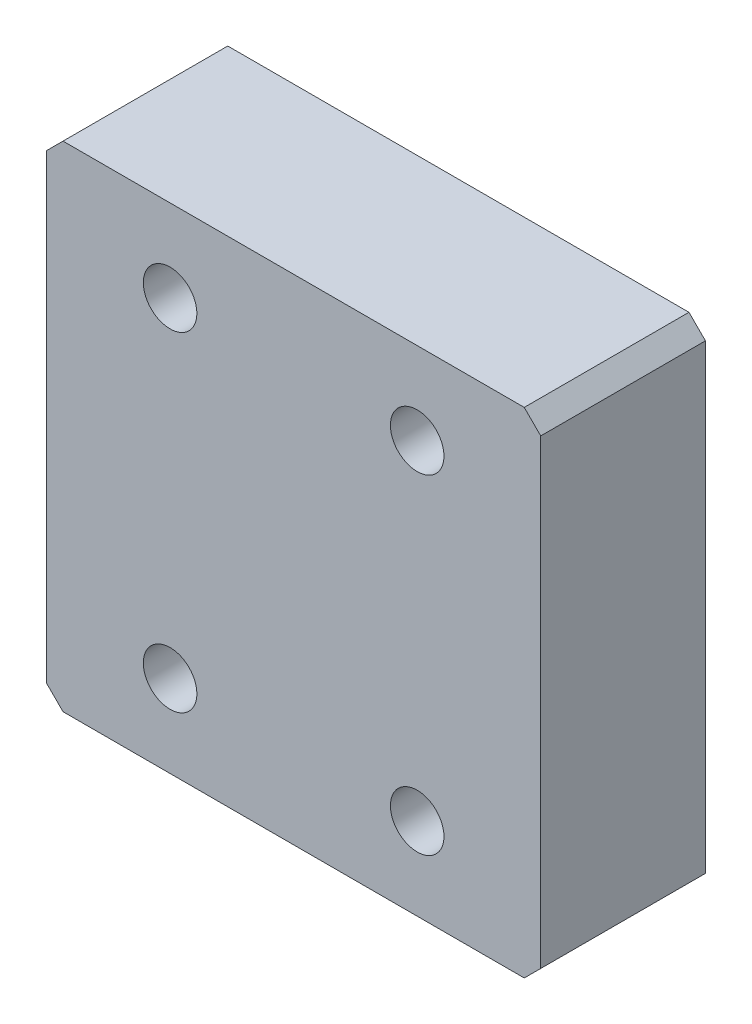
ISO-10303-21;
HEADER;
FILE_DESCRIPTION(('STEP AP214'),'2;1');
FILE_NAME('part.step','',(''),(''),'','','');
FILE_SCHEMA(('AUTOMOTIVE_DESIGN { 1 0 10303 214 1 1 1 1 }'));
ENDSEC;
DATA;
#1=APPLICATION_CONTEXT('core data for automotive mechanical design processes');
#2=APPLICATION_PROTOCOL_DEFINITION('international standard','automotive_design',2000,#1);
#3=PRODUCT_CONTEXT('',#1,'mechanical');
#4=PRODUCT('Part','Part','',(#3));
#5=PRODUCT_RELATED_PRODUCT_CATEGORY('part','',(#4));
#6=PRODUCT_DEFINITION_FORMATION('','',#4);
#7=PRODUCT_DEFINITION_CONTEXT('part definition',#1,'design');
#8=PRODUCT_DEFINITION('design','',#6,#7);
#9=PRODUCT_DEFINITION_SHAPE('','',#8);
#10=(LENGTH_UNIT() NAMED_UNIT(*) SI_UNIT(.MILLI.,.METRE.));
#11=(NAMED_UNIT(*) PLANE_ANGLE_UNIT() SI_UNIT($,.RADIAN.));
#12=(NAMED_UNIT(*) SI_UNIT($,.STERADIAN.) SOLID_ANGLE_UNIT());
#13=UNCERTAINTY_MEASURE_WITH_UNIT(LENGTH_MEASURE(1.E-05),#10,'distance_accuracy_value','');
#14=(GEOMETRIC_REPRESENTATION_CONTEXT(3) GLOBAL_UNCERTAINTY_ASSIGNED_CONTEXT((#13)) GLOBAL_UNIT_ASSIGNED_CONTEXT((#10,
#11,#12)) REPRESENTATION_CONTEXT('',''));
#15=CARTESIAN_POINT('',(0.,0.,0.));
#16=DIRECTION('',(0.,0.,1.));
#17=DIRECTION('',(1.,0.,0.));
#18=AXIS2_PLACEMENT_3D('',#15,#16,#17);
#19=CARTESIAN_POINT('',(0.,0.,20.));
#20=DIRECTION('',(0.,0.,1.));
#21=DIRECTION('',(1.,0.,0.));
#22=AXIS2_PLACEMENT_3D('',#19,#20,#21);
#23=PLANE('',#22);
#24=CARTESIAN_POINT('',(15.,-20.,20.));
#25=DIRECTION('',(0.,0.,1.));
#26=DIRECTION('',(1.,0.,0.));
#27=AXIS2_PLACEMENT_3D('',#24,#25,#26);
#28=CIRCLE('',#27,3.25);
#29=CARTESIAN_POINT('',(18.25,-20.,20.));
#30=VERTEX_POINT('',#29);
#31=EDGE_CURVE('E186',#30,#30,#28,.T.);
#32=ORIENTED_EDGE('',*,*,#31,.F.);
#33=EDGE_LOOP('',(#32));
#34=FACE_BOUND('',#33,.T.);
#35=CARTESIAN_POINT('',(-15.,20.,20.));
#36=DIRECTION('',(0.,0.,1.));
#37=DIRECTION('',(1.,0.,0.));
#38=AXIS2_PLACEMENT_3D('',#35,#36,#37);
#39=CIRCLE('',#38,3.25);
#40=CARTESIAN_POINT('',(-11.75,20.,20.));
#41=VERTEX_POINT('',#40);
#42=EDGE_CURVE('E127',#41,#41,#39,.T.);
#43=ORIENTED_EDGE('',*,*,#42,.F.);
#44=EDGE_LOOP('',(#43));
#45=FACE_BOUND('',#44,.T.);
#46=DIRECTION('',(1.,0.,0.));
#47=VECTOR('',#46,1.);
#48=CARTESIAN_POINT('',(-30.,-30.,20.));
#49=LINE('',#48,#47);
#50=CARTESIAN_POINT('',(-28.,-30.,20.));
#51=VERTEX_POINT('',#50);
#52=CARTESIAN_POINT('',(28.,-30.,20.));
#53=VERTEX_POINT('',#52);
#54=EDGE_CURVE('E136',#51,#53,#49,.T.);
#55=ORIENTED_EDGE('',*,*,#54,.T.);
#56=DIRECTION('',(-0.707106781186549,-0.707106781186546,0.));
#57=VECTOR('',#56,1.);
#58=CARTESIAN_POINT('',(28.9999999999999,-29.,20.));
#59=LINE('',#58,#57);
#60=CARTESIAN_POINT('',(30.,-28.,20.));
#61=VERTEX_POINT('',#60);
#62=EDGE_CURVE('E155',#53,#61,#59,.F.);
#63=ORIENTED_EDGE('',*,*,#62,.T.);
#64=DIRECTION('',(0.,1.,0.));
#65=VECTOR('',#64,1.);
#66=CARTESIAN_POINT('',(30.,30.,20.));
#67=LINE('',#66,#65);
#68=CARTESIAN_POINT('',(30.,28.,20.));
#69=VERTEX_POINT('',#68);
#70=EDGE_CURVE('E119',#61,#69,#67,.T.);
#71=ORIENTED_EDGE('',*,*,#70,.T.);
#72=DIRECTION('',(0.707106781186545,-0.70710678118655,0.));
#73=VECTOR('',#72,1.);
#74=CARTESIAN_POINT('',(29.0000000000001,28.9999999999999,20.));
#75=LINE('',#74,#73);
#76=CARTESIAN_POINT('',(28.,30.,20.));
#77=VERTEX_POINT('',#76);
#78=EDGE_CURVE('E150',#69,#77,#75,.F.);
#79=ORIENTED_EDGE('',*,*,#78,.T.);
#80=DIRECTION('',(-1.,0.,0.));
#81=VECTOR('',#80,1.);
#82=CARTESIAN_POINT('',(-30.,30.,20.));
#83=LINE('',#82,#81);
#84=CARTESIAN_POINT('',(-28.,30.,20.));
#85=VERTEX_POINT('',#84);
#86=EDGE_CURVE('E166',#77,#85,#83,.T.);
#87=ORIENTED_EDGE('',*,*,#86,.T.);
#88=DIRECTION('',(0.707106781186549,0.707106781186546,0.));
#89=VECTOR('',#88,1.);
#90=CARTESIAN_POINT('',(-28.9999999999999,29.,20.));
#91=LINE('',#90,#89);
#92=CARTESIAN_POINT('',(-30.,28.,20.));
#93=VERTEX_POINT('',#92);
#94=EDGE_CURVE('E55',#85,#93,#91,.F.);
#95=ORIENTED_EDGE('',*,*,#94,.T.);
#96=DIRECTION('',(0.,-1.,0.));
#97=VECTOR('',#96,1.);
#98=CARTESIAN_POINT('',(-30.,30.,20.));
#99=LINE('',#98,#97);
#100=CARTESIAN_POINT('',(-30.,-28.,20.));
#101=VERTEX_POINT('',#100);
#102=EDGE_CURVE('E174',#93,#101,#99,.T.);
#103=ORIENTED_EDGE('',*,*,#102,.T.);
#104=DIRECTION('',(-0.707106781186545,0.70710678118655,0.));
#105=VECTOR('',#104,1.);
#106=CARTESIAN_POINT('',(-29.0000000000001,-28.9999999999999,20.));
#107=LINE('',#106,#105);
#108=EDGE_CURVE('E153',#101,#51,#107,.F.);
#109=ORIENTED_EDGE('',*,*,#108,.T.);
#110=EDGE_LOOP('',(#55,#63,#71,#79,#87,#95,#103,#109));
#111=FACE_BOUND('',#110,.T.);
#112=CARTESIAN_POINT('',(15.,20.,20.));
#113=DIRECTION('',(0.,0.,1.));
#114=DIRECTION('',(-1.,0.,0.));
#115=AXIS2_PLACEMENT_3D('',#112,#113,#114);
#116=CIRCLE('',#115,3.25);
#117=CARTESIAN_POINT('',(11.75,20.,20.));
#118=VERTEX_POINT('',#117);
#119=EDGE_CURVE('E181',#118,#118,#116,.T.);
#120=ORIENTED_EDGE('',*,*,#119,.F.);
#121=EDGE_LOOP('',(#120));
#122=FACE_BOUND('',#121,.T.);
#123=CARTESIAN_POINT('',(-15.,-20.,20.));
#124=DIRECTION('',(0.,0.,1.));
#125=DIRECTION('',(-1.,0.,0.));
#126=AXIS2_PLACEMENT_3D('',#123,#124,#125);
#127=CIRCLE('',#126,3.25);
#128=CARTESIAN_POINT('',(-18.25,-20.,20.));
#129=VERTEX_POINT('',#128);
#130=EDGE_CURVE('E192',#129,#129,#127,.T.);
#131=ORIENTED_EDGE('',*,*,#130,.F.);
#132=EDGE_LOOP('',(#131));
#133=FACE_BOUND('',#132,.T.);
#134=ADVANCED_FACE('F33',(#34,#45,#111,#122,#133),#23,.T.);
#135=CARTESIAN_POINT('',(0.,0.,0.));
#136=DIRECTION('',(0.,0.,1.));
#137=DIRECTION('',(1.,0.,0.));
#138=AXIS2_PLACEMENT_3D('',#135,#136,#137);
#139=PLANE('',#138);
#140=DIRECTION('',(0.,1.,0.));
#141=VECTOR('',#140,1.);
#142=CARTESIAN_POINT('',(30.,30.,0.));
#143=LINE('',#142,#141);
#144=CARTESIAN_POINT('',(30.,-28.,0.));
#145=VERTEX_POINT('',#144);
#146=CARTESIAN_POINT('',(30.,28.,0.));
#147=VERTEX_POINT('',#146);
#148=EDGE_CURVE('E116',#145,#147,#143,.T.);
#149=ORIENTED_EDGE('',*,*,#148,.F.);
#150=DIRECTION('',(0.707106781186549,0.707106781186546,0.));
#151=VECTOR('',#150,1.);
#152=CARTESIAN_POINT('',(30.,-28.,0.));
#153=LINE('',#152,#151);
#154=CARTESIAN_POINT('',(28.,-30.,0.));
#155=VERTEX_POINT('',#154);
#156=EDGE_CURVE('E99',#145,#155,#153,.F.);
#157=ORIENTED_EDGE('',*,*,#156,.T.);
#158=DIRECTION('',(1.,0.,0.));
#159=VECTOR('',#158,1.);
#160=CARTESIAN_POINT('',(-30.,-30.,0.));
#161=LINE('',#160,#159);
#162=CARTESIAN_POINT('',(-28.,-30.,0.));
#163=VERTEX_POINT('',#162);
#164=EDGE_CURVE('E140',#163,#155,#161,.T.);
#165=ORIENTED_EDGE('',*,*,#164,.F.);
#166=DIRECTION('',(0.707106781186545,-0.70710678118655,0.));
#167=VECTOR('',#166,1.);
#168=CARTESIAN_POINT('',(-28.,-30.,0.));
#169=LINE('',#168,#167);
#170=CARTESIAN_POINT('',(-30.,-28.,0.));
#171=VERTEX_POINT('',#170);
#172=EDGE_CURVE('E110',#163,#171,#169,.F.);
#173=ORIENTED_EDGE('',*,*,#172,.T.);
#174=DIRECTION('',(0.,-1.,0.));
#175=VECTOR('',#174,1.);
#176=CARTESIAN_POINT('',(-30.,30.,0.));
#177=LINE('',#176,#175);
#178=CARTESIAN_POINT('',(-30.,28.,0.));
#179=VERTEX_POINT('',#178);
#180=EDGE_CURVE('E130',#179,#171,#177,.T.);
#181=ORIENTED_EDGE('',*,*,#180,.F.);
#182=DIRECTION('',(-0.707106781186549,-0.707106781186546,0.));
#183=VECTOR('',#182,1.);
#184=CARTESIAN_POINT('',(-30.,28.,0.));
#185=LINE('',#184,#183);
#186=CARTESIAN_POINT('',(-28.,30.,0.));
#187=VERTEX_POINT('',#186);
#188=EDGE_CURVE('E144',#179,#187,#185,.F.);
#189=ORIENTED_EDGE('',*,*,#188,.T.);
#190=DIRECTION('',(-1.,0.,0.));
#191=VECTOR('',#190,1.);
#192=CARTESIAN_POINT('',(-30.,30.,0.));
#193=LINE('',#192,#191);
#194=CARTESIAN_POINT('',(28.,30.,0.));
#195=VERTEX_POINT('',#194);
#196=EDGE_CURVE('E126',#195,#187,#193,.T.);
#197=ORIENTED_EDGE('',*,*,#196,.F.);
#198=DIRECTION('',(-0.707106781186545,0.70710678118655,0.));
#199=VECTOR('',#198,1.);
#200=CARTESIAN_POINT('',(28.,30.,0.));
#201=LINE('',#200,#199);
#202=EDGE_CURVE('E120',#195,#147,#201,.F.);
#203=ORIENTED_EDGE('',*,*,#202,.T.);
#204=EDGE_LOOP('',(#149,#157,#165,#173,#181,#189,#197,#203));
#205=FACE_BOUND('',#204,.T.);
#206=CARTESIAN_POINT('',(-15.,20.,0.));
#207=DIRECTION('',(0.,0.,1.));
#208=DIRECTION('',(1.,0.,0.));
#209=AXIS2_PLACEMENT_3D('',#206,#207,#208);
#210=CIRCLE('',#209,3.25);
#211=CARTESIAN_POINT('',(-11.75,20.,0.));
#212=VERTEX_POINT('',#211);
#213=EDGE_CURVE('E133',#212,#212,#210,.T.);
#214=ORIENTED_EDGE('',*,*,#213,.T.);
#215=EDGE_LOOP('',(#214));
#216=FACE_BOUND('',#215,.T.);
#217=CARTESIAN_POINT('',(15.,20.,0.));
#218=DIRECTION('',(0.,0.,1.));
#219=DIRECTION('',(-1.,0.,0.));
#220=AXIS2_PLACEMENT_3D('',#217,#218,#219);
#221=CIRCLE('',#220,3.25);
#222=CARTESIAN_POINT('',(11.75,20.,0.));
#223=VERTEX_POINT('',#222);
#224=EDGE_CURVE('E183',#223,#223,#221,.T.);
#225=ORIENTED_EDGE('',*,*,#224,.T.);
#226=EDGE_LOOP('',(#225));
#227=FACE_BOUND('',#226,.T.);
#228=CARTESIAN_POINT('',(15.,-20.,0.));
#229=DIRECTION('',(0.,0.,1.));
#230=DIRECTION('',(1.,0.,0.));
#231=AXIS2_PLACEMENT_3D('',#228,#229,#230);
#232=CIRCLE('',#231,3.25);
#233=CARTESIAN_POINT('',(18.25,-20.,0.));
#234=VERTEX_POINT('',#233);
#235=EDGE_CURVE('E189',#234,#234,#232,.T.);
#236=ORIENTED_EDGE('',*,*,#235,.T.);
#237=EDGE_LOOP('',(#236));
#238=FACE_BOUND('',#237,.T.);
#239=CARTESIAN_POINT('',(-15.,-20.,0.));
#240=DIRECTION('',(0.,0.,1.));
#241=DIRECTION('',(-1.,0.,0.));
#242=AXIS2_PLACEMENT_3D('',#239,#240,#241);
#243=CIRCLE('',#242,3.25);
#244=CARTESIAN_POINT('',(-18.25,-20.,0.));
#245=VERTEX_POINT('',#244);
#246=EDGE_CURVE('E195',#245,#245,#243,.T.);
#247=ORIENTED_EDGE('',*,*,#246,.T.);
#248=EDGE_LOOP('',(#247));
#249=FACE_BOUND('',#248,.T.);
#250=ADVANCED_FACE('F123',(#205,#216,#227,#238,#249),#139,.F.);
#251=CARTESIAN_POINT('',(30.,30.,20.));
#252=DIRECTION('',(-1.,0.,0.));
#253=DIRECTION('',(0.,-1.,0.));
#254=AXIS2_PLACEMENT_3D('',#251,#252,#253);
#255=PLANE('',#254);
#256=ORIENTED_EDGE('',*,*,#70,.F.);
#257=DIRECTION('',(0.,0.,-1.));
#258=VECTOR('',#257,1.);
#259=CARTESIAN_POINT('',(30.,-28.,20.));
#260=LINE('',#259,#258);
#261=EDGE_CURVE('E103',#61,#145,#260,.T.);
#262=ORIENTED_EDGE('',*,*,#261,.T.);
#263=ORIENTED_EDGE('',*,*,#148,.T.);
#264=DIRECTION('',(0.,0.,1.));
#265=VECTOR('',#264,1.);
#266=CARTESIAN_POINT('',(30.,28.,20.));
#267=LINE('',#266,#265);
#268=EDGE_CURVE('E121',#147,#69,#267,.T.);
#269=ORIENTED_EDGE('',*,*,#268,.T.);
#270=EDGE_LOOP('',(#256,#262,#263,#269));
#271=FACE_BOUND('',#270,.T.);
#272=ADVANCED_FACE('F115',(#271),#255,.F.);
#273=CARTESIAN_POINT('',(-30.,30.,20.));
#274=DIRECTION('',(0.,-1.,0.));
#275=DIRECTION('',(0.,0.,-1.));
#276=AXIS2_PLACEMENT_3D('',#273,#274,#275);
#277=PLANE('',#276);
#278=ORIENTED_EDGE('',*,*,#196,.T.);
#279=DIRECTION('',(0.,0.,1.));
#280=VECTOR('',#279,1.);
#281=CARTESIAN_POINT('',(-28.,30.,20.));
#282=LINE('',#281,#280);
#283=EDGE_CURVE('E11',#187,#85,#282,.T.);
#284=ORIENTED_EDGE('',*,*,#283,.T.);
#285=ORIENTED_EDGE('',*,*,#86,.F.);
#286=DIRECTION('',(0.,0.,-1.));
#287=VECTOR('',#286,1.);
#288=CARTESIAN_POINT('',(28.,30.,20.));
#289=LINE('',#288,#287);
#290=EDGE_CURVE('E41',#77,#195,#289,.T.);
#291=ORIENTED_EDGE('',*,*,#290,.T.);
#292=EDGE_LOOP('',(#278,#284,#285,#291));
#293=FACE_BOUND('',#292,.T.);
#294=ADVANCED_FACE('F164',(#293),#277,.F.);
#295=CARTESIAN_POINT('',(-30.,30.,20.));
#296=DIRECTION('',(1.,0.,0.));
#297=DIRECTION('',(0.,1.,0.));
#298=AXIS2_PLACEMENT_3D('',#295,#296,#297);
#299=PLANE('',#298);
#300=ORIENTED_EDGE('',*,*,#180,.T.);
#301=DIRECTION('',(0.,0.,1.));
#302=VECTOR('',#301,1.);
#303=CARTESIAN_POINT('',(-30.,-28.,20.));
#304=LINE('',#303,#302);
#305=EDGE_CURVE('E48',#171,#101,#304,.T.);
#306=ORIENTED_EDGE('',*,*,#305,.T.);
#307=ORIENTED_EDGE('',*,*,#102,.F.);
#308=DIRECTION('',(0.,0.,-1.));
#309=VECTOR('',#308,1.);
#310=CARTESIAN_POINT('',(-30.,28.,20.));
#311=LINE('',#310,#309);
#312=EDGE_CURVE('E157',#93,#179,#311,.T.);
#313=ORIENTED_EDGE('',*,*,#312,.T.);
#314=EDGE_LOOP('',(#300,#306,#307,#313));
#315=FACE_BOUND('',#314,.T.);
#316=ADVANCED_FACE('F173',(#315),#299,.F.);
#317=CARTESIAN_POINT('',(-30.,-30.,20.));
#318=DIRECTION('',(0.,1.,0.));
#319=DIRECTION('',(0.,0.,1.));
#320=AXIS2_PLACEMENT_3D('',#317,#318,#319);
#321=PLANE('',#320);
#322=ORIENTED_EDGE('',*,*,#164,.T.);
#323=DIRECTION('',(0.,0.,1.));
#324=VECTOR('',#323,1.);
#325=CARTESIAN_POINT('',(28.,-30.,20.));
#326=LINE('',#325,#324);
#327=EDGE_CURVE('E104',#155,#53,#326,.T.);
#328=ORIENTED_EDGE('',*,*,#327,.T.);
#329=ORIENTED_EDGE('',*,*,#54,.F.);
#330=DIRECTION('',(0.,0.,-1.));
#331=VECTOR('',#330,1.);
#332=CARTESIAN_POINT('',(-28.,-30.,20.));
#333=LINE('',#332,#331);
#334=EDGE_CURVE('E109',#51,#163,#333,.T.);
#335=ORIENTED_EDGE('',*,*,#334,.T.);
#336=EDGE_LOOP('',(#322,#328,#329,#335));
#337=FACE_BOUND('',#336,.T.);
#338=ADVANCED_FACE('F217',(#337),#321,.F.);
#339=CARTESIAN_POINT('',(-15.,20.,20.));
#340=DIRECTION('',(0.,0.,-1.));
#341=DIRECTION('',(-1.,0.,0.));
#342=AXIS2_PLACEMENT_3D('',#339,#340,#341);
#343=CYLINDRICAL_SURFACE('',#342,3.25);
#344=ORIENTED_EDGE('',*,*,#42,.T.);
#345=EDGE_LOOP('',(#344));
#346=FACE_BOUND('',#345,.T.);
#347=ORIENTED_EDGE('',*,*,#213,.F.);
#348=EDGE_LOOP('',(#347));
#349=FACE_BOUND('',#348,.T.);
#350=ADVANCED_FACE('F214',(#346,#349),#343,.F.);
#351=CARTESIAN_POINT('',(15.,20.,20.));
#352=DIRECTION('',(0.,0.,-1.));
#353=DIRECTION('',(-1.,0.,0.));
#354=AXIS2_PLACEMENT_3D('',#351,#352,#353);
#355=CYLINDRICAL_SURFACE('',#354,3.25);
#356=ORIENTED_EDGE('',*,*,#119,.T.);
#357=EDGE_LOOP('',(#356));
#358=FACE_BOUND('',#357,.T.);
#359=ORIENTED_EDGE('',*,*,#224,.F.);
#360=EDGE_LOOP('',(#359));
#361=FACE_BOUND('',#360,.T.);
#362=ADVANCED_FACE('F243',(#358,#361),#355,.F.);
#363=CARTESIAN_POINT('',(15.,-20.,20.));
#364=DIRECTION('',(0.,0.,-1.));
#365=DIRECTION('',(-1.,0.,0.));
#366=AXIS2_PLACEMENT_3D('',#363,#364,#365);
#367=CYLINDRICAL_SURFACE('',#366,3.25);
#368=ORIENTED_EDGE('',*,*,#31,.T.);
#369=EDGE_LOOP('',(#368));
#370=FACE_BOUND('',#369,.T.);
#371=ORIENTED_EDGE('',*,*,#235,.F.);
#372=EDGE_LOOP('',(#371));
#373=FACE_BOUND('',#372,.T.);
#374=ADVANCED_FACE('F246',(#370,#373),#367,.F.);
#375=CARTESIAN_POINT('',(-15.,-20.,20.));
#376=DIRECTION('',(0.,0.,-1.));
#377=DIRECTION('',(-1.,0.,0.));
#378=AXIS2_PLACEMENT_3D('',#375,#376,#377);
#379=CYLINDRICAL_SURFACE('',#378,3.25);
#380=ORIENTED_EDGE('',*,*,#130,.T.);
#381=EDGE_LOOP('',(#380));
#382=FACE_BOUND('',#381,.T.);
#383=ORIENTED_EDGE('',*,*,#246,.F.);
#384=EDGE_LOOP('',(#383));
#385=FACE_BOUND('',#384,.T.);
#386=ADVANCED_FACE('F201',(#382,#385),#379,.F.);
#387=CARTESIAN_POINT('',(30.,-28.,20.));
#388=DIRECTION('',(-0.707106781186546,0.707106781186549,0.));
#389=DIRECTION('',(0.,0.,-1.));
#390=AXIS2_PLACEMENT_3D('',#387,#388,#389);
#391=PLANE('',#390);
#392=ORIENTED_EDGE('',*,*,#62,.F.);
#393=ORIENTED_EDGE('',*,*,#327,.F.);
#394=ORIENTED_EDGE('',*,*,#156,.F.);
#395=ORIENTED_EDGE('',*,*,#261,.F.);
#396=EDGE_LOOP('',(#392,#393,#394,#395));
#397=FACE_BOUND('',#396,.T.);
#398=ADVANCED_FACE('F102',(#397),#391,.F.);
#399=CARTESIAN_POINT('',(-28.,-30.,20.));
#400=DIRECTION('',(0.70710678118655,0.707106781186545,0.));
#401=DIRECTION('',(0.,0.,-1.));
#402=AXIS2_PLACEMENT_3D('',#399,#400,#401);
#403=PLANE('',#402);
#404=ORIENTED_EDGE('',*,*,#108,.F.);
#405=ORIENTED_EDGE('',*,*,#305,.F.);
#406=ORIENTED_EDGE('',*,*,#172,.F.);
#407=ORIENTED_EDGE('',*,*,#334,.F.);
#408=EDGE_LOOP('',(#404,#405,#406,#407));
#409=FACE_BOUND('',#408,.T.);
#410=ADVANCED_FACE('F229',(#409),#403,.F.);
#411=CARTESIAN_POINT('',(-30.,28.,20.));
#412=DIRECTION('',(0.707106781186546,-0.707106781186549,0.));
#413=DIRECTION('',(0.,0.,-1.));
#414=AXIS2_PLACEMENT_3D('',#411,#412,#413);
#415=PLANE('',#414);
#416=ORIENTED_EDGE('',*,*,#94,.F.);
#417=ORIENTED_EDGE('',*,*,#283,.F.);
#418=ORIENTED_EDGE('',*,*,#188,.F.);
#419=ORIENTED_EDGE('',*,*,#312,.F.);
#420=EDGE_LOOP('',(#416,#417,#418,#419));
#421=FACE_BOUND('',#420,.T.);
#422=ADVANCED_FACE('F172',(#421),#415,.F.);
#423=CARTESIAN_POINT('',(28.,30.,20.));
#424=DIRECTION('',(-0.70710678118655,-0.707106781186545,0.));
#425=DIRECTION('',(0.,0.,-1.));
#426=AXIS2_PLACEMENT_3D('',#423,#424,#425);
#427=PLANE('',#426);
#428=ORIENTED_EDGE('',*,*,#78,.F.);
#429=ORIENTED_EDGE('',*,*,#268,.F.);
#430=ORIENTED_EDGE('',*,*,#202,.F.);
#431=ORIENTED_EDGE('',*,*,#290,.F.);
#432=EDGE_LOOP('',(#428,#429,#430,#431));
#433=FACE_BOUND('',#432,.T.);
#434=ADVANCED_FACE('F35',(#433),#427,.F.);
#435=CLOSED_SHELL('',(#134,#250,#272,#294,#316,#338,#350,#362,#374,#386,#398,#410,#422,#434));
#436=MANIFOLD_SOLID_BREP('B2',#435);
#437=ADVANCED_BREP_SHAPE_REPRESENTATION('',(#18,#436),#14);
#438=SHAPE_DEFINITION_REPRESENTATION(#9,#437);
ENDSEC;
END-ISO-10303-21;
